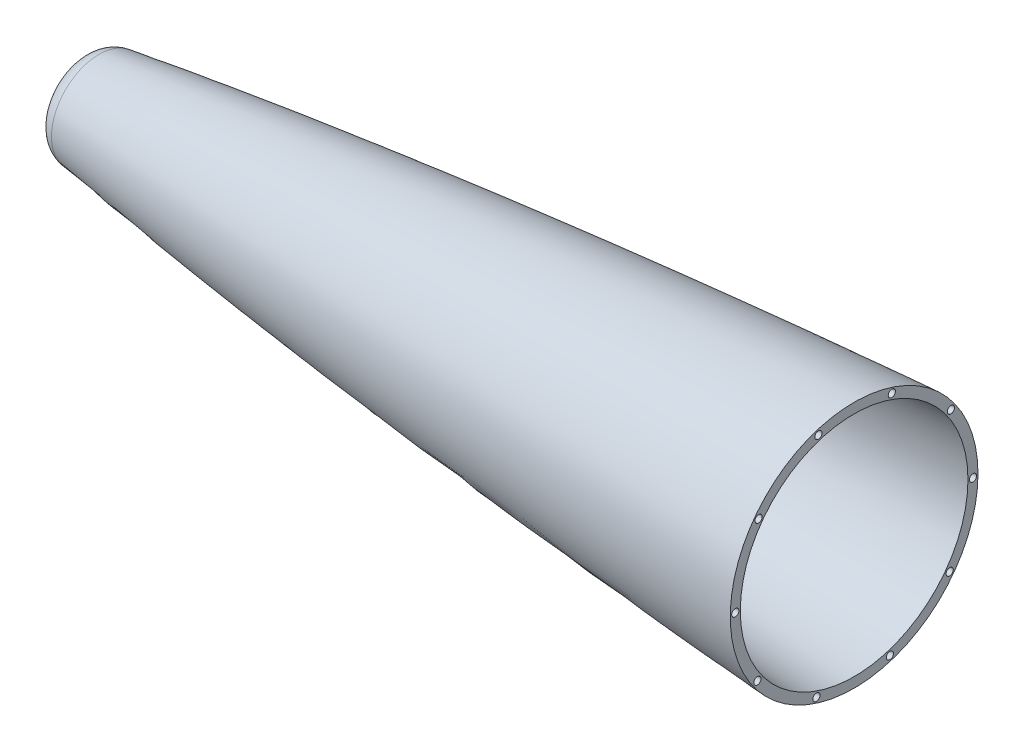
ISO-10303-21;
HEADER;
FILE_DESCRIPTION(('STEP AP214'),'2;1');
FILE_NAME('part.step','',(''),(''),'','','');
FILE_SCHEMA(('AUTOMOTIVE_DESIGN { 1 0 10303 214 1 1 1 1 }'));
ENDSEC;
DATA;
#1=APPLICATION_CONTEXT('core data for automotive mechanical design processes');
#2=APPLICATION_PROTOCOL_DEFINITION('international standard','automotive_design',2000,#1);
#3=PRODUCT_CONTEXT('',#1,'mechanical');
#4=PRODUCT('Part','Part','',(#3));
#5=PRODUCT_RELATED_PRODUCT_CATEGORY('part','',(#4));
#6=PRODUCT_DEFINITION_FORMATION('','',#4);
#7=PRODUCT_DEFINITION_CONTEXT('part definition',#1,'design');
#8=PRODUCT_DEFINITION('design','',#6,#7);
#9=PRODUCT_DEFINITION_SHAPE('','',#8);
#10=(LENGTH_UNIT() NAMED_UNIT(*) SI_UNIT(.MILLI.,.METRE.));
#11=(NAMED_UNIT(*) PLANE_ANGLE_UNIT() SI_UNIT($,.RADIAN.));
#12=(NAMED_UNIT(*) SI_UNIT($,.STERADIAN.) SOLID_ANGLE_UNIT());
#13=UNCERTAINTY_MEASURE_WITH_UNIT(LENGTH_MEASURE(1.E-05),#10,'distance_accuracy_value','');
#14=(GEOMETRIC_REPRESENTATION_CONTEXT(3) GLOBAL_UNCERTAINTY_ASSIGNED_CONTEXT((#13)) GLOBAL_UNIT_ASSIGNED_CONTEXT((#10,
#11,#12)) REPRESENTATION_CONTEXT('',''));
#15=CARTESIAN_POINT('',(0.,0.,0.));
#16=DIRECTION('',(0.,0.,1.));
#17=DIRECTION('',(1.,0.,0.));
#18=AXIS2_PLACEMENT_3D('',#15,#16,#17);
#19=CARTESIAN_POINT('',(-259.812483714893,11.460570284297,0.));
#20=CARTESIAN_POINT('',(-287.312106379697,10.5623408515305,0.));
#21=CARTESIAN_POINT('',(-342.298022137353,8.17156900853598,0.));
#22=CARTESIAN_POINT('',(-452.140135715747,1.83352473554385,0.));
#23=CARTESIAN_POINT('',(-589.280273051557,-8.5121188078909,0.));
#24=CARTESIAN_POINT('',(-726.176632388446,-21.7709007537404,0.));
#25=CARTESIAN_POINT('',(-835.465785428388,-34.5887261399924,0.));
#26=CARTESIAN_POINT('',(-890.027026606975,-41.9652027624198,0.));
#27=CARTESIAN_POINT('',(-917.245364412614,-46.0396236215406,0.));
#28=B_SPLINE_CURVE_WITH_KNOTS('',3,(#19,#20,#21,#22,#23,#24,#25,#26,#27),.UNSPECIFIED.,.F.,.F.,
(4,1,1,1,1,1,4),(0.121539177885851,0.200323508121493,0.279107838357135,0.436676498828419,
0.594245159299703,0.673029489535345,0.751813819770986),.UNSPECIFIED.);
#29=CARTESIAN_POINT('',(0.,-76.2,0.));
#30=DIRECTION('',(1.,0.,0.));
#31=AXIS1_PLACEMENT('',#29,#30);
#32=SURFACE_OF_REVOLUTION('',#28,#31);
#33=CARTESIAN_POINT('',(-917.245364412614,-76.2,0.));
#34=DIRECTION('',(1.,0.,0.));
#35=DIRECTION('',(0.,0.,-1.));
#36=AXIS2_PLACEMENT_3D('',#33,#34,#35);
#37=CIRCLE('',#36,30.1603763784594);
#38=CARTESIAN_POINT('',(-917.245364412614,-76.2,-30.1603763784594));
#39=VERTEX_POINT('',#38);
#40=EDGE_CURVE('E10',#39,#39,#37,.T.);
#41=ORIENTED_EDGE('',*,*,#40,.T.);
#42=EDGE_LOOP('',(#41));
#43=FACE_BOUND('',#42,.T.);
#44=CARTESIAN_POINT('',(-438.15,-76.2,0.));
#45=DIRECTION('',(1.,0.,0.));
#46=DIRECTION('',(0.,0.,-1.));
#47=AXIS2_PLACEMENT_3D('',#44,#45,#46);
#48=CIRCLE('',#47,78.5859575802931);
#49=CARTESIAN_POINT('',(-438.15,-76.2,-78.5859575802931));
#50=VERTEX_POINT('',#49);
#51=EDGE_CURVE('E53',#50,#50,#48,.F.);
#52=ORIENTED_EDGE('',*,*,#51,.T.);
#53=EDGE_LOOP('',(#52));
#54=FACE_BOUND('',#53,.T.);
#55=ADVANCED_FACE('F33',(#43,#54),#32,.F.);
#56=CARTESIAN_POINT('',(-259.605182082093,5.11395496327444,0.));
#57=CARTESIAN_POINT('',(-267.12768254606,4.86824499819252,0.));
#58=CARTESIAN_POINT('',(-283.426031509972,4.28566928092725,0.));
#59=CARTESIAN_POINT('',(-317.270262328934,2.88050564552106,0.));
#60=CARTESIAN_POINT('',(-361.130016616179,0.711244662128463,0.));
#61=CARTESIAN_POINT('',(-431.275457268552,-3.37195649395594,0.));
#62=CARTESIAN_POINT('',(-501.372917975129,-8.26687627302136,0.));
#63=CARTESIAN_POINT('',(-571.414486842692,-13.8916826479783,0.));
#64=CARTESIAN_POINT('',(-623.914744737059,-18.4776988889442,0.));
#65=CARTESIAN_POINT('',(-676.380314026956,-23.4393497952148,0.));
#66=CARTESIAN_POINT('',(-728.805663240347,-28.7990620723279,0.));
#67=CARTESIAN_POINT('',(-772.453634614019,-33.627485173269,0.));
#68=CARTESIAN_POINT('',(-807.341816529924,-37.7391545432386,0.));
#69=CARTESIAN_POINT('',(-833.490683910714,-40.9589001471484,0.));
#70=CARTESIAN_POINT('',(-859.619375691871,-44.3289411148186,0.));
#71=CARTESIAN_POINT('',(-885.723877264818,-47.8693351323976,0.));
#72=CARTESIAN_POINT('',(-904.61249297492,-50.577906922154,0.));
#73=CARTESIAN_POINT('',(-914.800968172167,-52.0944643953555,0.));
#74=CARTESIAN_POINT('',(-916.305282206307,-52.3196511250938,0.));
#75=B_SPLINE_CURVE_WITH_KNOTS('',3,(#56,#57,#58,#59,#60,#61,#62,#63,#64,#65,#66,#67,#68,#69,#70,
#71,#72,#73,#74),.UNSPECIFIED.,.F.,.F.,(4,1,1,1,1,1,1,1,1,1,1,1,1,1,1,1,4),(0.121539177885851,
0.143122913317239,0.168303261053087,0.218663956524784,0.26902465199648,0.369746042939873,
0.420106738411569,0.470467433883266,0.520828129354962,0.571188824826659,0.621549520298355,
0.646729868034203,0.671910215770052,0.6970905635059,0.722270911241748,0.747451258977596,
0.751813819770986),.UNSPECIFIED.);
#76=CARTESIAN_POINT('',(0.,-76.2,0.));
#77=DIRECTION('',(1.,0.,0.));
#78=AXIS1_PLACEMENT('',#76,#77);
#79=SURFACE_OF_REVOLUTION('',#75,#78);
#80=CARTESIAN_POINT('',(-916.305282206307,-76.2,0.));
#81=DIRECTION('',(1.,0.,0.));
#82=DIRECTION('',(0.,0.,-1.));
#83=AXIS2_PLACEMENT_3D('',#80,#81,#82);
#84=CIRCLE('',#83,23.8803488749062);
#85=CARTESIAN_POINT('',(-916.305282206307,-76.2,-23.8803488749062));
#86=VERTEX_POINT('',#85);
#87=EDGE_CURVE('E50',#86,#86,#84,.T.);
#88=ORIENTED_EDGE('',*,*,#87,.F.);
#89=EDGE_LOOP('',(#88));
#90=FACE_BOUND('',#89,.T.);
#91=CARTESIAN_POINT('',(-438.15,-76.2,0.));
#92=DIRECTION('',(1.,0.,0.));
#93=DIRECTION('',(0.,0.,-1.));
#94=AXIS2_PLACEMENT_3D('',#91,#92,#93);
#95=CIRCLE('',#94,72.2219194807445);
#96=CARTESIAN_POINT('',(-438.15,-76.2,-72.2219194807445));
#97=VERTEX_POINT('',#96);
#98=EDGE_CURVE('E37',#97,#97,#95,.F.);
#99=ORIENTED_EDGE('',*,*,#98,.F.);
#100=EDGE_LOOP('',(#99));
#101=FACE_BOUND('',#100,.T.);
#102=ADVANCED_FACE('F65',(#90,#101),#79,.T.);
#103=CARTESIAN_POINT('',(-915.3652,-76.2,0.));
#104=DIRECTION('',(1.,0.,0.));
#105=DIRECTION('',(0.,0.,-1.));
#106=AXIS2_PLACEMENT_3D('',#103,#104,#105);
#107=TOROIDAL_SURFACE('',#106,17.6003213713529,12.7);
#108=CARTESIAN_POINT('',(-928.0652,-76.2,0.));
#109=DIRECTION('',(1.,0.,0.));
#110=DIRECTION('',(0.,0.,-1.));
#111=AXIS2_PLACEMENT_3D('',#108,#109,#110);
#112=CIRCLE('',#111,17.6003213713529);
#113=CARTESIAN_POINT('',(-928.0652,-76.2,-17.6003213713529));
#114=VERTEX_POINT('',#113);
#115=EDGE_CURVE('E41',#114,#114,#112,.T.);
#116=ORIENTED_EDGE('',*,*,#115,.T.);
#117=EDGE_LOOP('',(#116));
#118=FACE_BOUND('',#117,.T.);
#119=ORIENTED_EDGE('',*,*,#40,.F.);
#120=EDGE_LOOP('',(#119));
#121=FACE_BOUND('',#120,.T.);
#122=ADVANCED_FACE('F69',(#118,#121),#107,.T.);
#123=CARTESIAN_POINT('',(0.,-76.2,0.));
#124=DIRECTION('',(1.,0.,0.));
#125=DIRECTION('',(0.,0.,-1.));
#126=AXIS2_PLACEMENT_3D('',#123,#124,#125);
#127=CYLINDRICAL_SURFACE('',#126,17.6003213713529);
#128=ORIENTED_EDGE('',*,*,#115,.F.);
#129=EDGE_LOOP('',(#128));
#130=FACE_BOUND('',#129,.T.);
#131=CARTESIAN_POINT('',(-921.7152,-76.2,0.));
#132=DIRECTION('',(1.,0.,0.));
#133=DIRECTION('',(0.,0.,-1.));
#134=AXIS2_PLACEMENT_3D('',#131,#132,#133);
#135=CIRCLE('',#134,17.6003213713529);
#136=CARTESIAN_POINT('',(-921.7152,-76.2,-17.6003213713529));
#137=VERTEX_POINT('',#136);
#138=EDGE_CURVE('E45',#137,#137,#135,.T.);
#139=ORIENTED_EDGE('',*,*,#138,.T.);
#140=EDGE_LOOP('',(#139));
#141=FACE_BOUND('',#140,.T.);
#142=ADVANCED_FACE('F76',(#130,#141),#127,.F.);
#143=CARTESIAN_POINT('',(-915.3652,-76.2,0.));
#144=DIRECTION('',(1.,0.,0.));
#145=DIRECTION('',(0.,0.,-1.));
#146=AXIS2_PLACEMENT_3D('',#143,#144,#145);
#147=TOROIDAL_SURFACE('',#146,17.6003213713529,6.35000000000007);
#148=ORIENTED_EDGE('',*,*,#138,.F.);
#149=EDGE_LOOP('',(#148));
#150=FACE_BOUND('',#149,.T.);
#151=ORIENTED_EDGE('',*,*,#87,.T.);
#152=EDGE_LOOP('',(#151));
#153=FACE_BOUND('',#152,.T.);
#154=ADVANCED_FACE('F73',(#150,#153),#147,.F.);
#155=CARTESIAN_POINT('',(-438.15,-76.2,0.));
#156=DIRECTION('',(1.,0.,0.));
#157=DIRECTION('',(0.,0.,-1.));
#158=AXIS2_PLACEMENT_3D('',#155,#156,#157);
#159=PLANE('',#158);
#160=CARTESIAN_POINT('',(-438.15,-4.28598565713197,22.6744016257323));
#161=DIRECTION('',(1.,0.,0.));
#162=DIRECTION('',(0.,0.,-1.));
#163=AXIS2_PLACEMENT_3D('',#160,#161,#162);
#164=CIRCLE('',#163,2.286);
#165=CARTESIAN_POINT('',(-438.15,-4.28598565713197,20.3884016257323));
#166=VERTEX_POINT('',#165);
#167=EDGE_CURVE('E104',#166,#166,#164,.T.);
#168=ORIENTED_EDGE('',*,*,#167,.F.);
#169=EDGE_LOOP('',(#168));
#170=FACE_BOUND('',#169,.T.);
#171=CARTESIAN_POINT('',(-438.15,-31.3480191430601,60.6139733163877));
#172=DIRECTION('',(1.,0.,0.));
#173=DIRECTION('',(0.,0.,-1.));
#174=AXIS2_PLACEMENT_3D('',#171,#172,#173);
#175=CIRCLE('',#174,2.286);
#176=CARTESIAN_POINT('',(-438.15,-31.3480191430601,58.3279733163877));
#177=VERTEX_POINT('',#176);
#178=EDGE_CURVE('E110',#177,#177,#175,.T.);
#179=ORIENTED_EDGE('',*,*,#178,.F.);
#180=EDGE_LOOP('',(#179));
#181=FACE_BOUND('',#180,.T.);
#182=CARTESIAN_POINT('',(-438.15,-75.5419848535801,75.4010673933609));
#183=DIRECTION('',(1.,0.,0.));
#184=DIRECTION('',(0.,0.,-1.));
#185=AXIS2_PLACEMENT_3D('',#182,#183,#184);
#186=CIRCLE('',#185,2.286);
#187=CARTESIAN_POINT('',(-438.15,-75.5419848535801,73.1150673933609));
#188=VERTEX_POINT('',#187);
#189=EDGE_CURVE('E116',#188,#188,#186,.T.);
#190=ORIENTED_EDGE('',*,*,#189,.F.);
#191=EDGE_LOOP('',(#190));
#192=FACE_BOUND('',#191,.T.);
#193=CARTESIAN_POINT('',(-438.15,-119.987289984921,61.3875165140904));
#194=DIRECTION('',(1.,0.,0.));
#195=DIRECTION('',(0.,0.,-1.));
#196=AXIS2_PLACEMENT_3D('',#193,#194,#195);
#197=CIRCLE('',#196,2.28599999999998);
#198=CARTESIAN_POINT('',(-438.15,-119.987289984921,59.1015165140904));
#199=VERTEX_POINT('',#198);
#200=EDGE_CURVE('E122',#199,#199,#197,.T.);
#201=ORIENTED_EDGE('',*,*,#200,.F.);
#202=EDGE_LOOP('',(#201));
#203=FACE_BOUND('',#202,.T.);
#204=CARTESIAN_POINT('',(-438.15,-147.70733861727,23.9260208113815));
#205=DIRECTION('',(1.,0.,0.));
#206=DIRECTION('',(0.,0.,-1.));
#207=AXIS2_PLACEMENT_3D('',#204,#205,#206);
#208=CIRCLE('',#207,2.286);
#209=CARTESIAN_POINT('',(-438.15,-147.70733861727,21.6400208113815));
#210=VERTEX_POINT('',#209);
#211=EDGE_CURVE('E128',#210,#210,#208,.T.);
#212=ORIENTED_EDGE('',*,*,#211,.F.);
#213=EDGE_LOOP('',(#212));
#214=FACE_BOUND('',#213,.T.);
#215=CARTESIAN_POINT('',(-438.15,-148.11401434287,-22.6744016257389));
#216=DIRECTION('',(1.,0.,0.));
#217=DIRECTION('',(0.,0.,-1.));
#218=AXIS2_PLACEMENT_3D('',#215,#216,#217);
#219=CIRCLE('',#218,2.28600000000001);
#220=CARTESIAN_POINT('',(-438.15,-148.11401434287,-24.9604016257389));
#221=VERTEX_POINT('',#220);
#222=EDGE_CURVE('E134',#221,#221,#219,.T.);
#223=ORIENTED_EDGE('',*,*,#222,.F.);
#224=EDGE_LOOP('',(#223));
#225=FACE_BOUND('',#224,.T.);
#226=CARTESIAN_POINT('',(-438.15,-121.051980856942,-60.6139733163942));
#227=DIRECTION('',(1.,0.,0.));
#228=DIRECTION('',(0.,0.,-1.));
#229=AXIS2_PLACEMENT_3D('',#226,#227,#228);
#230=CIRCLE('',#229,2.286);
#231=CARTESIAN_POINT('',(-438.15,-121.051980856942,-62.8999733163942));
#232=VERTEX_POINT('',#231);
#233=EDGE_CURVE('E142',#232,#232,#230,.T.);
#234=ORIENTED_EDGE('',*,*,#233,.F.);
#235=EDGE_LOOP('',(#234));
#236=FACE_BOUND('',#235,.T.);
#237=CARTESIAN_POINT('',(-438.15,-76.8580151464216,-75.401067393367));
#238=DIRECTION('',(1.,0.,0.));
#239=DIRECTION('',(0.,0.,-1.));
#240=AXIS2_PLACEMENT_3D('',#237,#238,#239);
#241=CIRCLE('',#240,2.28599999999999);
#242=CARTESIAN_POINT('',(-438.15,-76.8580151464216,-77.687067393367));
#243=VERTEX_POINT('',#242);
#244=EDGE_CURVE('E150',#243,#243,#241,.T.);
#245=ORIENTED_EDGE('',*,*,#244,.F.);
#246=EDGE_LOOP('',(#245));
#247=FACE_BOUND('',#246,.T.);
#248=CARTESIAN_POINT('',(-438.15,-32.4127100150811,-61.3875165140962));
#249=DIRECTION('',(1.,0.,0.));
#250=DIRECTION('',(0.,0.,-1.));
#251=AXIS2_PLACEMENT_3D('',#248,#249,#250);
#252=CIRCLE('',#251,2.286);
#253=CARTESIAN_POINT('',(-438.15,-32.4127100150811,-63.6735165140962));
#254=VERTEX_POINT('',#253);
#255=EDGE_CURVE('E157',#254,#254,#252,.T.);
#256=ORIENTED_EDGE('',*,*,#255,.F.);
#257=EDGE_LOOP('',(#256));
#258=FACE_BOUND('',#257,.T.);
#259=CARTESIAN_POINT('',(-438.15,-4.69266138273224,-23.9260208113871));
#260=DIRECTION('',(1.,0.,0.));
#261=DIRECTION('',(0.,0.,-1.));
#262=AXIS2_PLACEMENT_3D('',#259,#260,#261);
#263=CIRCLE('',#262,2.286);
#264=CARTESIAN_POINT('',(-438.15,-4.69266138273224,-26.2120208113871));
#265=VERTEX_POINT('',#264);
#266=EDGE_CURVE('E98',#265,#265,#263,.T.);
#267=ORIENTED_EDGE('',*,*,#266,.F.);
#268=EDGE_LOOP('',(#267));
#269=FACE_BOUND('',#268,.T.);
#270=ORIENTED_EDGE('',*,*,#51,.F.);
#271=EDGE_LOOP('',(#270));
#272=FACE_BOUND('',#271,.T.);
#273=ORIENTED_EDGE('',*,*,#98,.T.);
#274=EDGE_LOOP('',(#273));
#275=FACE_BOUND('',#274,.T.);
#276=ADVANCED_FACE('F71',(#170,#181,#192,#203,#214,#225,#236,#247,#258,#269,#272,#275),#159,.T.);
#277=CARTESIAN_POINT('',(-448.31,-4.69266138273224,-23.9260208113871));
#278=DIRECTION('',(1.,0.,0.));
#279=DIRECTION('',(0.,0.,-1.));
#280=AXIS2_PLACEMENT_3D('',#277,#278,#279);
#281=CYLINDRICAL_SURFACE('',#280,2.286);
#282=CARTESIAN_POINT('',(-448.31,-4.69266138273224,-23.9260208113871));
#283=DIRECTION('',(1.,0.,0.));
#284=DIRECTION('',(0.,0.,-1.));
#285=AXIS2_PLACEMENT_3D('',#282,#283,#284);
#286=CIRCLE('',#285,2.286);
#287=CARTESIAN_POINT('',(-448.31,-4.69266138273224,-26.2120208113871));
#288=VERTEX_POINT('',#287);
#289=EDGE_CURVE('E96',#288,#288,#286,.T.);
#290=ORIENTED_EDGE('',*,*,#289,.F.);
#291=EDGE_LOOP('',(#290));
#292=FACE_BOUND('',#291,.T.);
#293=ORIENTED_EDGE('',*,*,#266,.T.);
#294=EDGE_LOOP('',(#293));
#295=FACE_BOUND('',#294,.T.);
#296=ADVANCED_FACE('F174',(#292,#295),#281,.F.);
#297=CARTESIAN_POINT('',(-448.31,-4.69266138273224,-23.9260208113871));
#298=DIRECTION('',(1.,0.,0.));
#299=DIRECTION('',(0.,0.,-1.));
#300=AXIS2_PLACEMENT_3D('',#297,#298,#299);
#301=PLANE('',#300);
#302=ORIENTED_EDGE('',*,*,#289,.T.);
#303=EDGE_LOOP('',(#302));
#304=FACE_BOUND('',#303,.T.);
#305=ADVANCED_FACE('F168',(#304),#301,.T.);
#306=CARTESIAN_POINT('',(-448.31,-32.4127100150811,-61.3875165140962));
#307=DIRECTION('',(1.,0.,0.));
#308=DIRECTION('',(0.,0.,-1.));
#309=AXIS2_PLACEMENT_3D('',#306,#307,#308);
#310=CYLINDRICAL_SURFACE('',#309,2.286);
#311=CARTESIAN_POINT('',(-448.31,-32.4127100150811,-61.3875165140962));
#312=DIRECTION('',(1.,0.,0.));
#313=DIRECTION('',(0.,0.,-1.));
#314=AXIS2_PLACEMENT_3D('',#311,#312,#313);
#315=CIRCLE('',#314,2.286);
#316=CARTESIAN_POINT('',(-448.31,-32.4127100150811,-63.6735165140962));
#317=VERTEX_POINT('',#316);
#318=EDGE_CURVE('E101',#317,#317,#315,.T.);
#319=ORIENTED_EDGE('',*,*,#318,.F.);
#320=EDGE_LOOP('',(#319));
#321=FACE_BOUND('',#320,.T.);
#322=ORIENTED_EDGE('',*,*,#255,.T.);
#323=EDGE_LOOP('',(#322));
#324=FACE_BOUND('',#323,.T.);
#325=ADVANCED_FACE('F165',(#321,#324),#310,.F.);
#326=CARTESIAN_POINT('',(-448.31,-32.4127100150811,-61.3875165140962));
#327=DIRECTION('',(1.,0.,0.));
#328=DIRECTION('',(0.,0.,-1.));
#329=AXIS2_PLACEMENT_3D('',#326,#327,#328);
#330=PLANE('',#329);
#331=ORIENTED_EDGE('',*,*,#318,.T.);
#332=EDGE_LOOP('',(#331));
#333=FACE_BOUND('',#332,.T.);
#334=ADVANCED_FACE('F163',(#333),#330,.T.);
#335=CARTESIAN_POINT('',(-448.31,-76.8580151464216,-75.401067393367));
#336=DIRECTION('',(1.,0.,0.));
#337=DIRECTION('',(0.,0.,-1.));
#338=AXIS2_PLACEMENT_3D('',#335,#336,#337);
#339=CYLINDRICAL_SURFACE('',#338,2.28599999999999);
#340=CARTESIAN_POINT('',(-448.31,-76.8580151464216,-75.401067393367));
#341=DIRECTION('',(1.,0.,0.));
#342=DIRECTION('',(0.,0.,-1.));
#343=AXIS2_PLACEMENT_3D('',#340,#341,#342);
#344=CIRCLE('',#343,2.28599999999999);
#345=CARTESIAN_POINT('',(-448.31,-76.8580151464216,-77.687067393367));
#346=VERTEX_POINT('',#345);
#347=EDGE_CURVE('E154',#346,#346,#344,.T.);
#348=ORIENTED_EDGE('',*,*,#347,.F.);
#349=EDGE_LOOP('',(#348));
#350=FACE_BOUND('',#349,.T.);
#351=ORIENTED_EDGE('',*,*,#244,.T.);
#352=EDGE_LOOP('',(#351));
#353=FACE_BOUND('',#352,.T.);
#354=ADVANCED_FACE('F247',(#350,#353),#339,.F.);
#355=CARTESIAN_POINT('',(-448.31,-76.8580151464216,-75.401067393367));
#356=DIRECTION('',(1.,0.,0.));
#357=DIRECTION('',(0.,0.,-1.));
#358=AXIS2_PLACEMENT_3D('',#355,#356,#357);
#359=PLANE('',#358);
#360=ORIENTED_EDGE('',*,*,#347,.T.);
#361=EDGE_LOOP('',(#360));
#362=FACE_BOUND('',#361,.T.);
#363=ADVANCED_FACE('F242',(#362),#359,.T.);
#364=CARTESIAN_POINT('',(-448.31,-121.051980856942,-60.6139733163942));
#365=DIRECTION('',(1.,0.,0.));
#366=DIRECTION('',(0.,0.,-1.));
#367=AXIS2_PLACEMENT_3D('',#364,#365,#366);
#368=CYLINDRICAL_SURFACE('',#367,2.286);
#369=CARTESIAN_POINT('',(-448.31,-121.051980856942,-60.6139733163942));
#370=DIRECTION('',(1.,0.,0.));
#371=DIRECTION('',(0.,0.,-1.));
#372=AXIS2_PLACEMENT_3D('',#369,#370,#371);
#373=CIRCLE('',#372,2.286);
#374=CARTESIAN_POINT('',(-448.31,-121.051980856942,-62.8999733163942));
#375=VERTEX_POINT('',#374);
#376=EDGE_CURVE('E146',#375,#375,#373,.T.);
#377=ORIENTED_EDGE('',*,*,#376,.F.);
#378=EDGE_LOOP('',(#377));
#379=FACE_BOUND('',#378,.T.);
#380=ORIENTED_EDGE('',*,*,#233,.T.);
#381=EDGE_LOOP('',(#380));
#382=FACE_BOUND('',#381,.T.);
#383=ADVANCED_FACE('F239',(#379,#382),#368,.F.);
#384=CARTESIAN_POINT('',(-448.31,-121.051980856942,-60.6139733163942));
#385=DIRECTION('',(1.,0.,0.));
#386=DIRECTION('',(0.,0.,-1.));
#387=AXIS2_PLACEMENT_3D('',#384,#385,#386);
#388=PLANE('',#387);
#389=ORIENTED_EDGE('',*,*,#376,.T.);
#390=EDGE_LOOP('',(#389));
#391=FACE_BOUND('',#390,.T.);
#392=ADVANCED_FACE('F234',(#391),#388,.T.);
#393=CARTESIAN_POINT('',(-448.31,-148.11401434287,-22.6744016257389));
#394=DIRECTION('',(1.,0.,0.));
#395=DIRECTION('',(0.,0.,-1.));
#396=AXIS2_PLACEMENT_3D('',#393,#394,#395);
#397=CYLINDRICAL_SURFACE('',#396,2.28600000000001);
#398=CARTESIAN_POINT('',(-448.31,-148.11401434287,-22.6744016257389));
#399=DIRECTION('',(1.,0.,0.));
#400=DIRECTION('',(0.,0.,-1.));
#401=AXIS2_PLACEMENT_3D('',#398,#399,#400);
#402=CIRCLE('',#401,2.28600000000001);
#403=CARTESIAN_POINT('',(-448.31,-148.11401434287,-24.9604016257389));
#404=VERTEX_POINT('',#403);
#405=EDGE_CURVE('E138',#404,#404,#402,.T.);
#406=ORIENTED_EDGE('',*,*,#405,.F.);
#407=EDGE_LOOP('',(#406));
#408=FACE_BOUND('',#407,.T.);
#409=ORIENTED_EDGE('',*,*,#222,.T.);
#410=EDGE_LOOP('',(#409));
#411=FACE_BOUND('',#410,.T.);
#412=ADVANCED_FACE('F231',(#408,#411),#397,.F.);
#413=CARTESIAN_POINT('',(-448.31,-148.11401434287,-22.6744016257389));
#414=DIRECTION('',(1.,0.,0.));
#415=DIRECTION('',(0.,0.,-1.));
#416=AXIS2_PLACEMENT_3D('',#413,#414,#415);
#417=PLANE('',#416);
#418=ORIENTED_EDGE('',*,*,#405,.T.);
#419=EDGE_LOOP('',(#418));
#420=FACE_BOUND('',#419,.T.);
#421=ADVANCED_FACE('F226',(#420),#417,.T.);
#422=CARTESIAN_POINT('',(-448.31,-147.70733861727,23.9260208113815));
#423=DIRECTION('',(1.,0.,0.));
#424=DIRECTION('',(0.,0.,-1.));
#425=AXIS2_PLACEMENT_3D('',#422,#423,#424);
#426=CYLINDRICAL_SURFACE('',#425,2.286);
#427=CARTESIAN_POINT('',(-448.31,-147.70733861727,23.9260208113815));
#428=DIRECTION('',(1.,0.,0.));
#429=DIRECTION('',(0.,0.,-1.));
#430=AXIS2_PLACEMENT_3D('',#427,#428,#429);
#431=CIRCLE('',#430,2.286);
#432=CARTESIAN_POINT('',(-448.31,-147.70733861727,21.6400208113815));
#433=VERTEX_POINT('',#432);
#434=EDGE_CURVE('E131',#433,#433,#431,.T.);
#435=ORIENTED_EDGE('',*,*,#434,.F.);
#436=EDGE_LOOP('',(#435));
#437=FACE_BOUND('',#436,.T.);
#438=ORIENTED_EDGE('',*,*,#211,.T.);
#439=EDGE_LOOP('',(#438));
#440=FACE_BOUND('',#439,.T.);
#441=ADVANCED_FACE('F223',(#437,#440),#426,.F.);
#442=CARTESIAN_POINT('',(-448.31,-147.70733861727,23.9260208113815));
#443=DIRECTION('',(1.,0.,0.));
#444=DIRECTION('',(0.,0.,-1.));
#445=AXIS2_PLACEMENT_3D('',#442,#443,#444);
#446=PLANE('',#445);
#447=ORIENTED_EDGE('',*,*,#434,.T.);
#448=EDGE_LOOP('',(#447));
#449=FACE_BOUND('',#448,.T.);
#450=ADVANCED_FACE('F218',(#449),#446,.T.);
#451=CARTESIAN_POINT('',(-448.31,-119.987289984921,61.3875165140904));
#452=DIRECTION('',(1.,0.,0.));
#453=DIRECTION('',(0.,0.,-1.));
#454=AXIS2_PLACEMENT_3D('',#451,#452,#453);
#455=CYLINDRICAL_SURFACE('',#454,2.28599999999998);
#456=CARTESIAN_POINT('',(-448.31,-119.987289984921,61.3875165140904));
#457=DIRECTION('',(1.,0.,0.));
#458=DIRECTION('',(0.,0.,-1.));
#459=AXIS2_PLACEMENT_3D('',#456,#457,#458);
#460=CIRCLE('',#459,2.28599999999998);
#461=CARTESIAN_POINT('',(-448.31,-119.987289984921,59.1015165140904));
#462=VERTEX_POINT('',#461);
#463=EDGE_CURVE('E125',#462,#462,#460,.T.);
#464=ORIENTED_EDGE('',*,*,#463,.F.);
#465=EDGE_LOOP('',(#464));
#466=FACE_BOUND('',#465,.T.);
#467=ORIENTED_EDGE('',*,*,#200,.T.);
#468=EDGE_LOOP('',(#467));
#469=FACE_BOUND('',#468,.T.);
#470=ADVANCED_FACE('F215',(#466,#469),#455,.F.);
#471=CARTESIAN_POINT('',(-448.31,-119.987289984921,61.3875165140904));
#472=DIRECTION('',(1.,0.,0.));
#473=DIRECTION('',(0.,0.,-1.));
#474=AXIS2_PLACEMENT_3D('',#471,#472,#473);
#475=PLANE('',#474);
#476=ORIENTED_EDGE('',*,*,#463,.T.);
#477=EDGE_LOOP('',(#476));
#478=FACE_BOUND('',#477,.T.);
#479=ADVANCED_FACE('F210',(#478),#475,.T.);
#480=CARTESIAN_POINT('',(-448.31,-75.5419848535801,75.4010673933609));
#481=DIRECTION('',(1.,0.,0.));
#482=DIRECTION('',(0.,0.,-1.));
#483=AXIS2_PLACEMENT_3D('',#480,#481,#482);
#484=CYLINDRICAL_SURFACE('',#483,2.286);
#485=CARTESIAN_POINT('',(-448.31,-75.5419848535801,75.4010673933609));
#486=DIRECTION('',(1.,0.,0.));
#487=DIRECTION('',(0.,0.,-1.));
#488=AXIS2_PLACEMENT_3D('',#485,#486,#487);
#489=CIRCLE('',#488,2.286);
#490=CARTESIAN_POINT('',(-448.31,-75.5419848535801,73.1150673933609));
#491=VERTEX_POINT('',#490);
#492=EDGE_CURVE('E119',#491,#491,#489,.T.);
#493=ORIENTED_EDGE('',*,*,#492,.F.);
#494=EDGE_LOOP('',(#493));
#495=FACE_BOUND('',#494,.T.);
#496=ORIENTED_EDGE('',*,*,#189,.T.);
#497=EDGE_LOOP('',(#496));
#498=FACE_BOUND('',#497,.T.);
#499=ADVANCED_FACE('F207',(#495,#498),#484,.F.);
#500=CARTESIAN_POINT('',(-448.31,-75.5419848535801,75.4010673933609));
#501=DIRECTION('',(1.,0.,0.));
#502=DIRECTION('',(0.,0.,-1.));
#503=AXIS2_PLACEMENT_3D('',#500,#501,#502);
#504=PLANE('',#503);
#505=ORIENTED_EDGE('',*,*,#492,.T.);
#506=EDGE_LOOP('',(#505));
#507=FACE_BOUND('',#506,.T.);
#508=ADVANCED_FACE('F202',(#507),#504,.T.);
#509=CARTESIAN_POINT('',(-448.31,-31.3480191430601,60.6139733163877));
#510=DIRECTION('',(1.,0.,0.));
#511=DIRECTION('',(0.,0.,-1.));
#512=AXIS2_PLACEMENT_3D('',#509,#510,#511);
#513=CYLINDRICAL_SURFACE('',#512,2.286);
#514=CARTESIAN_POINT('',(-448.31,-31.3480191430601,60.6139733163877));
#515=DIRECTION('',(1.,0.,0.));
#516=DIRECTION('',(0.,0.,-1.));
#517=AXIS2_PLACEMENT_3D('',#514,#515,#516);
#518=CIRCLE('',#517,2.286);
#519=CARTESIAN_POINT('',(-448.31,-31.3480191430601,58.3279733163877));
#520=VERTEX_POINT('',#519);
#521=EDGE_CURVE('E113',#520,#520,#518,.T.);
#522=ORIENTED_EDGE('',*,*,#521,.F.);
#523=EDGE_LOOP('',(#522));
#524=FACE_BOUND('',#523,.T.);
#525=ORIENTED_EDGE('',*,*,#178,.T.);
#526=EDGE_LOOP('',(#525));
#527=FACE_BOUND('',#526,.T.);
#528=ADVANCED_FACE('F199',(#524,#527),#513,.F.);
#529=CARTESIAN_POINT('',(-448.31,-31.3480191430601,60.6139733163877));
#530=DIRECTION('',(1.,0.,0.));
#531=DIRECTION('',(0.,0.,-1.));
#532=AXIS2_PLACEMENT_3D('',#529,#530,#531);
#533=PLANE('',#532);
#534=ORIENTED_EDGE('',*,*,#521,.T.);
#535=EDGE_LOOP('',(#534));
#536=FACE_BOUND('',#535,.T.);
#537=ADVANCED_FACE('F194',(#536),#533,.T.);
#538=CARTESIAN_POINT('',(-448.31,-4.28598565713197,22.6744016257323));
#539=DIRECTION('',(1.,0.,0.));
#540=DIRECTION('',(0.,0.,-1.));
#541=AXIS2_PLACEMENT_3D('',#538,#539,#540);
#542=CYLINDRICAL_SURFACE('',#541,2.286);
#543=CARTESIAN_POINT('',(-448.31,-4.28598565713197,22.6744016257323));
#544=DIRECTION('',(1.,0.,0.));
#545=DIRECTION('',(0.,0.,-1.));
#546=AXIS2_PLACEMENT_3D('',#543,#544,#545);
#547=CIRCLE('',#546,2.286);
#548=CARTESIAN_POINT('',(-448.31,-4.28598565713197,20.3884016257323));
#549=VERTEX_POINT('',#548);
#550=EDGE_CURVE('E107',#549,#549,#547,.T.);
#551=ORIENTED_EDGE('',*,*,#550,.F.);
#552=EDGE_LOOP('',(#551));
#553=FACE_BOUND('',#552,.T.);
#554=ORIENTED_EDGE('',*,*,#167,.T.);
#555=EDGE_LOOP('',(#554));
#556=FACE_BOUND('',#555,.T.);
#557=ADVANCED_FACE('F190',(#553,#556),#542,.F.);
#558=CARTESIAN_POINT('',(-448.31,-4.28598565713197,22.6744016257323));
#559=DIRECTION('',(1.,0.,0.));
#560=DIRECTION('',(0.,0.,-1.));
#561=AXIS2_PLACEMENT_3D('',#558,#559,#560);
#562=PLANE('',#561);
#563=ORIENTED_EDGE('',*,*,#550,.T.);
#564=EDGE_LOOP('',(#563));
#565=FACE_BOUND('',#564,.T.);
#566=ADVANCED_FACE('F193',(#565),#562,.T.);
#567=CLOSED_SHELL('',(#55,#102,#122,#142,#154,#276,#296,#305,#325,#334,#354,#363,#383,#392,#412,
#421,#441,#450,#470,#479,#499,#508,#528,#537,#557,#566));
#568=MANIFOLD_SOLID_BREP('B2',#567);
#569=ADVANCED_BREP_SHAPE_REPRESENTATION('',(#18,#568),#14);
#570=SHAPE_DEFINITION_REPRESENTATION(#9,#569);
ENDSEC;
END-ISO-10303-21;
